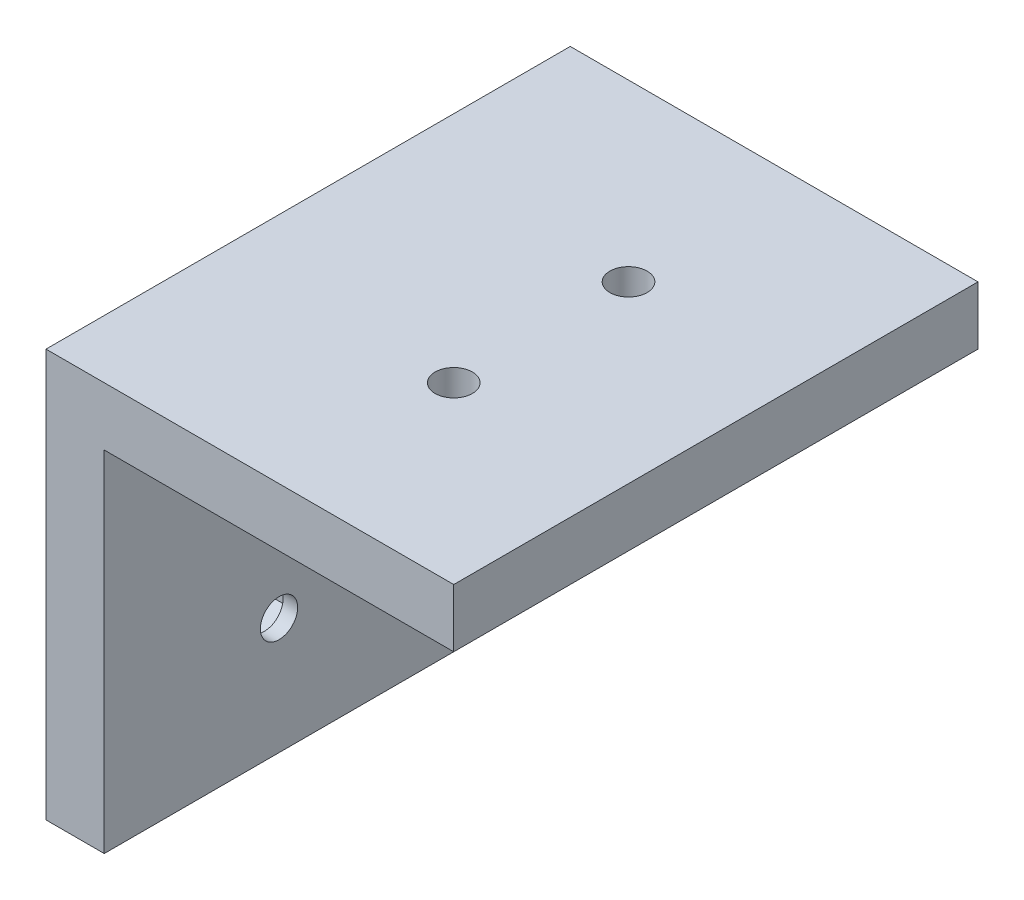
ISO-10303-21;
HEADER;
FILE_DESCRIPTION(('STEP AP214'),'2;1');
FILE_NAME('part.step','',(''),(''),'','','');
FILE_SCHEMA(('AUTOMOTIVE_DESIGN { 1 0 10303 214 1 1 1 1 }'));
ENDSEC;
DATA;
#1=APPLICATION_CONTEXT('core data for automotive mechanical design processes');
#2=APPLICATION_PROTOCOL_DEFINITION('international standard','automotive_design',2000,#1);
#3=PRODUCT_CONTEXT('',#1,'mechanical');
#4=PRODUCT('Part','Part','',(#3));
#5=PRODUCT_RELATED_PRODUCT_CATEGORY('part','',(#4));
#6=PRODUCT_DEFINITION_FORMATION('','',#4);
#7=PRODUCT_DEFINITION_CONTEXT('part definition',#1,'design');
#8=PRODUCT_DEFINITION('design','',#6,#7);
#9=PRODUCT_DEFINITION_SHAPE('','',#8);
#10=(LENGTH_UNIT() NAMED_UNIT(*) SI_UNIT(.MILLI.,.METRE.));
#11=(NAMED_UNIT(*) PLANE_ANGLE_UNIT() SI_UNIT($,.RADIAN.));
#12=(NAMED_UNIT(*) SI_UNIT($,.STERADIAN.) SOLID_ANGLE_UNIT());
#13=UNCERTAINTY_MEASURE_WITH_UNIT(LENGTH_MEASURE(1.E-05),#10,'distance_accuracy_value','');
#14=(GEOMETRIC_REPRESENTATION_CONTEXT(3) GLOBAL_UNCERTAINTY_ASSIGNED_CONTEXT((#13)) GLOBAL_UNIT_ASSIGNED_CONTEXT((#10,
#11,#12)) REPRESENTATION_CONTEXT('',''));
#15=CARTESIAN_POINT('',(0.,0.,0.));
#16=DIRECTION('',(0.,0.,1.));
#17=DIRECTION('',(1.,0.,0.));
#18=AXIS2_PLACEMENT_3D('',#15,#16,#17);
#19=CARTESIAN_POINT('',(-5.001,-20.,15.));
#20=DIRECTION('',(1.,0.,0.));
#21=DIRECTION('',(0.,1.,0.));
#22=AXIS2_PLACEMENT_3D('',#19,#20,#21);
#23=CYLINDRICAL_SURFACE('',#22,1.6);
#24=CARTESIAN_POINT('',(-5.,-20.,15.));
#25=DIRECTION('',(1.,0.,0.));
#26=DIRECTION('',(0.,0.,-1.));
#27=AXIS2_PLACEMENT_3D('',#24,#25,#26);
#28=CIRCLE('',#27,1.6);
#29=CARTESIAN_POINT('',(-5.,-20.,13.4));
#30=VERTEX_POINT('',#29);
#31=EDGE_CURVE('E170',#30,#30,#28,.F.);
#32=ORIENTED_EDGE('',*,*,#31,.T.);
#33=EDGE_LOOP('',(#32));
#34=FACE_BOUND('',#33,.T.);
#35=CARTESIAN_POINT('',(-3.75,-20.,15.));
#36=DIRECTION('',(1.,0.,0.));
#37=DIRECTION('',(0.,1.,0.));
#38=AXIS2_PLACEMENT_3D('',#35,#36,#37);
#39=CIRCLE('',#38,1.6);
#40=CARTESIAN_POINT('',(-3.75,-18.4,15.));
#41=VERTEX_POINT('',#40);
#42=EDGE_CURVE('E37',#41,#41,#39,.F.);
#43=ORIENTED_EDGE('',*,*,#42,.F.);
#44=EDGE_LOOP('',(#43));
#45=FACE_BOUND('',#44,.T.);
#46=ADVANCED_FACE('F33',(#34,#45),#23,.F.);
#47=CARTESIAN_POINT('',(-5.001,-20.,30.));
#48=DIRECTION('',(1.,0.,0.));
#49=DIRECTION('',(0.,1.,0.));
#50=AXIS2_PLACEMENT_3D('',#47,#48,#49);
#51=CYLINDRICAL_SURFACE('',#50,1.6);
#52=CARTESIAN_POINT('',(-5.,-20.,30.));
#53=DIRECTION('',(1.,0.,0.));
#54=DIRECTION('',(0.,0.,-1.));
#55=AXIS2_PLACEMENT_3D('',#52,#53,#54);
#56=CIRCLE('',#55,1.6);
#57=CARTESIAN_POINT('',(-5.,-20.,28.4));
#58=VERTEX_POINT('',#57);
#59=EDGE_CURVE('E128',#58,#58,#56,.F.);
#60=ORIENTED_EDGE('',*,*,#59,.T.);
#61=EDGE_LOOP('',(#60));
#62=FACE_BOUND('',#61,.T.);
#63=CARTESIAN_POINT('',(-3.75,-20.,30.));
#64=DIRECTION('',(1.,0.,0.));
#65=DIRECTION('',(0.,1.,0.));
#66=AXIS2_PLACEMENT_3D('',#63,#64,#65);
#67=CIRCLE('',#66,1.6);
#68=CARTESIAN_POINT('',(-3.75,-18.4,30.));
#69=VERTEX_POINT('',#68);
#70=EDGE_CURVE('E144',#69,#69,#67,.F.);
#71=ORIENTED_EDGE('',*,*,#70,.F.);
#72=EDGE_LOOP('',(#71));
#73=FACE_BOUND('',#72,.T.);
#74=ADVANCED_FACE('F205',(#62,#73),#51,.F.);
#75=CARTESIAN_POINT('',(0.,0.,45.));
#76=DIRECTION('',(0.,1.,0.));
#77=DIRECTION('',(0.,0.,1.));
#78=AXIS2_PLACEMENT_3D('',#75,#76,#77);
#79=PLANE('',#78);
#80=CARTESIAN_POINT('',(15.,0.,30.));
#81=DIRECTION('',(0.,-1.,0.));
#82=DIRECTION('',(0.,0.,-1.));
#83=AXIS2_PLACEMENT_3D('',#80,#81,#82);
#84=CIRCLE('',#83,1.6);
#85=CARTESIAN_POINT('',(15.,0.,28.4));
#86=VERTEX_POINT('',#85);
#87=EDGE_CURVE('E161',#86,#86,#84,.T.);
#88=ORIENTED_EDGE('',*,*,#87,.F.);
#89=EDGE_LOOP('',(#88));
#90=FACE_BOUND('',#89,.T.);
#91=CARTESIAN_POINT('',(15.,0.,15.));
#92=DIRECTION('',(0.,-1.,0.));
#93=DIRECTION('',(0.,0.,-1.));
#94=AXIS2_PLACEMENT_3D('',#91,#92,#93);
#95=CIRCLE('',#94,1.6);
#96=CARTESIAN_POINT('',(15.,0.,13.4));
#97=VERTEX_POINT('',#96);
#98=EDGE_CURVE('E152',#97,#97,#95,.T.);
#99=ORIENTED_EDGE('',*,*,#98,.F.);
#100=EDGE_LOOP('',(#99));
#101=FACE_BOUND('',#100,.T.);
#102=DIRECTION('',(1.,0.,0.));
#103=VECTOR('',#102,1.);
#104=CARTESIAN_POINT('',(0.,0.,0.));
#105=LINE('',#104,#103);
#106=CARTESIAN_POINT('',(0.,0.,0.));
#107=VERTEX_POINT('',#106);
#108=CARTESIAN_POINT('',(30.,0.,0.));
#109=VERTEX_POINT('',#108);
#110=EDGE_CURVE('E124',#107,#109,#105,.T.);
#111=ORIENTED_EDGE('',*,*,#110,.T.);
#112=DIRECTION('',(0.,0.,-1.));
#113=VECTOR('',#112,1.);
#114=CARTESIAN_POINT('',(30.,0.,45.));
#115=LINE('',#114,#113);
#116=CARTESIAN_POINT('',(30.,0.,45.));
#117=VERTEX_POINT('',#116);
#118=EDGE_CURVE('E11',#117,#109,#115,.T.);
#119=ORIENTED_EDGE('',*,*,#118,.F.);
#120=DIRECTION('',(1.,0.,0.));
#121=VECTOR('',#120,1.);
#122=CARTESIAN_POINT('',(0.,0.,45.));
#123=LINE('',#122,#121);
#124=CARTESIAN_POINT('',(0.,0.,45.));
#125=VERTEX_POINT('',#124);
#126=EDGE_CURVE('E135',#125,#117,#123,.T.);
#127=ORIENTED_EDGE('',*,*,#126,.F.);
#128=DIRECTION('',(0.,0.,-1.));
#129=VECTOR('',#128,1.);
#130=CARTESIAN_POINT('',(0.,0.,45.));
#131=LINE('',#130,#129);
#132=EDGE_CURVE('E120',#125,#107,#131,.T.);
#133=ORIENTED_EDGE('',*,*,#132,.T.);
#134=EDGE_LOOP('',(#111,#119,#127,#133));
#135=FACE_BOUND('',#134,.T.);
#136=ADVANCED_FACE('F35',(#90,#101,#135),#79,.F.);
#137=CARTESIAN_POINT('',(30.,0.,45.));
#138=DIRECTION('',(-1.,0.,0.));
#139=DIRECTION('',(0.,0.,1.));
#140=AXIS2_PLACEMENT_3D('',#137,#138,#139);
#141=PLANE('',#140);
#142=DIRECTION('',(0.,1.,0.));
#143=VECTOR('',#142,1.);
#144=CARTESIAN_POINT('',(30.,0.,0.));
#145=LINE('',#144,#143);
#146=CARTESIAN_POINT('',(30.,5.,0.));
#147=VERTEX_POINT('',#146);
#148=EDGE_CURVE('E127',#109,#147,#145,.T.);
#149=ORIENTED_EDGE('',*,*,#148,.T.);
#150=DIRECTION('',(0.,0.,-1.));
#151=VECTOR('',#150,1.);
#152=CARTESIAN_POINT('',(30.,5.,45.));
#153=LINE('',#152,#151);
#154=CARTESIAN_POINT('',(30.,5.,45.));
#155=VERTEX_POINT('',#154);
#156=EDGE_CURVE('E43',#155,#147,#153,.T.);
#157=ORIENTED_EDGE('',*,*,#156,.F.);
#158=DIRECTION('',(0.,1.,0.));
#159=VECTOR('',#158,1.);
#160=CARTESIAN_POINT('',(30.,0.,45.));
#161=LINE('',#160,#159);
#162=EDGE_CURVE('E90',#117,#155,#161,.T.);
#163=ORIENTED_EDGE('',*,*,#162,.F.);
#164=ORIENTED_EDGE('',*,*,#118,.T.);
#165=EDGE_LOOP('',(#149,#157,#163,#164));
#166=FACE_BOUND('',#165,.T.);
#167=ADVANCED_FACE('F181',(#166),#141,.F.);
#168=CARTESIAN_POINT('',(-5.,5.,45.));
#169=DIRECTION('',(0.,-1.,0.));
#170=DIRECTION('',(0.,0.,-1.));
#171=AXIS2_PLACEMENT_3D('',#168,#169,#170);
#172=PLANE('',#171);
#173=CARTESIAN_POINT('',(15.,5.,30.));
#174=DIRECTION('',(0.,-1.,0.));
#175=DIRECTION('',(0.,0.,-1.));
#176=AXIS2_PLACEMENT_3D('',#173,#174,#175);
#177=CIRCLE('',#176,1.6);
#178=CARTESIAN_POINT('',(15.,5.,28.4));
#179=VERTEX_POINT('',#178);
#180=EDGE_CURVE('E164',#179,#179,#177,.F.);
#181=ORIENTED_EDGE('',*,*,#180,.F.);
#182=EDGE_LOOP('',(#181));
#183=FACE_BOUND('',#182,.T.);
#184=CARTESIAN_POINT('',(15.,5.,15.));
#185=DIRECTION('',(0.,-1.,0.));
#186=DIRECTION('',(0.,0.,-1.));
#187=AXIS2_PLACEMENT_3D('',#184,#185,#186);
#188=CIRCLE('',#187,1.6);
#189=CARTESIAN_POINT('',(15.,5.,13.4));
#190=VERTEX_POINT('',#189);
#191=EDGE_CURVE('E156',#190,#190,#188,.F.);
#192=ORIENTED_EDGE('',*,*,#191,.F.);
#193=EDGE_LOOP('',(#192));
#194=FACE_BOUND('',#193,.T.);
#195=DIRECTION('',(-1.,0.,0.));
#196=VECTOR('',#195,1.);
#197=CARTESIAN_POINT('',(-5.,5.,0.));
#198=LINE('',#197,#196);
#199=CARTESIAN_POINT('',(-5.,5.,0.));
#200=VERTEX_POINT('',#199);
#201=EDGE_CURVE('E130',#147,#200,#198,.T.);
#202=ORIENTED_EDGE('',*,*,#201,.T.);
#203=DIRECTION('',(0.,0.,-1.));
#204=VECTOR('',#203,1.);
#205=CARTESIAN_POINT('',(-5.,5.,45.));
#206=LINE('',#205,#204);
#207=CARTESIAN_POINT('',(-5.,5.,45.));
#208=VERTEX_POINT('',#207);
#209=EDGE_CURVE('E115',#208,#200,#206,.T.);
#210=ORIENTED_EDGE('',*,*,#209,.F.);
#211=DIRECTION('',(-1.,0.,0.));
#212=VECTOR('',#211,1.);
#213=CARTESIAN_POINT('',(-5.,5.,45.));
#214=LINE('',#213,#212);
#215=EDGE_CURVE('E106',#155,#208,#214,.T.);
#216=ORIENTED_EDGE('',*,*,#215,.F.);
#217=ORIENTED_EDGE('',*,*,#156,.T.);
#218=EDGE_LOOP('',(#202,#210,#216,#217));
#219=FACE_BOUND('',#218,.T.);
#220=ADVANCED_FACE('F184',(#183,#194,#219),#172,.F.);
#221=CARTESIAN_POINT('',(-5.,-30.,45.));
#222=DIRECTION('',(1.,0.,0.));
#223=DIRECTION('',(0.,0.,-1.));
#224=AXIS2_PLACEMENT_3D('',#221,#222,#223);
#225=PLANE('',#224);
#226=ORIENTED_EDGE('',*,*,#59,.F.);
#227=EDGE_LOOP('',(#226));
#228=FACE_BOUND('',#227,.T.);
#229=ORIENTED_EDGE('',*,*,#31,.F.);
#230=EDGE_LOOP('',(#229));
#231=FACE_BOUND('',#230,.T.);
#232=DIRECTION('',(0.,-1.,0.));
#233=VECTOR('',#232,1.);
#234=CARTESIAN_POINT('',(-5.,-30.,0.));
#235=LINE('',#234,#233);
#236=CARTESIAN_POINT('',(-5.,-30.,0.));
#237=VERTEX_POINT('',#236);
#238=EDGE_CURVE('E114',#200,#237,#235,.T.);
#239=ORIENTED_EDGE('',*,*,#238,.T.);
#240=DIRECTION('',(0.,0.,-1.));
#241=VECTOR('',#240,1.);
#242=CARTESIAN_POINT('',(-5.,-30.,45.));
#243=LINE('',#242,#241);
#244=CARTESIAN_POINT('',(-5.,-30.,45.));
#245=VERTEX_POINT('',#244);
#246=EDGE_CURVE('E111',#245,#237,#243,.T.);
#247=ORIENTED_EDGE('',*,*,#246,.F.);
#248=DIRECTION('',(0.,-1.,0.));
#249=VECTOR('',#248,1.);
#250=CARTESIAN_POINT('',(-5.,-30.,45.));
#251=LINE('',#250,#249);
#252=EDGE_CURVE('E100',#208,#245,#251,.T.);
#253=ORIENTED_EDGE('',*,*,#252,.F.);
#254=ORIENTED_EDGE('',*,*,#209,.T.);
#255=EDGE_LOOP('',(#239,#247,#253,#254));
#256=FACE_BOUND('',#255,.T.);
#257=ADVANCED_FACE('F112',(#228,#231,#256),#225,.F.);
#258=CARTESIAN_POINT('',(0.,-30.,45.));
#259=DIRECTION('',(0.,1.,0.));
#260=DIRECTION('',(0.,0.,1.));
#261=AXIS2_PLACEMENT_3D('',#258,#259,#260);
#262=PLANE('',#261);
#263=DIRECTION('',(1.,0.,0.));
#264=VECTOR('',#263,1.);
#265=CARTESIAN_POINT('',(0.,-30.,0.));
#266=LINE('',#265,#264);
#267=CARTESIAN_POINT('',(0.,-30.,0.));
#268=VERTEX_POINT('',#267);
#269=EDGE_CURVE('E76',#237,#268,#266,.T.);
#270=ORIENTED_EDGE('',*,*,#269,.T.);
#271=DIRECTION('',(0.,0.,-1.));
#272=VECTOR('',#271,1.);
#273=CARTESIAN_POINT('',(0.,-30.,45.));
#274=LINE('',#273,#272);
#275=CARTESIAN_POINT('',(0.,-30.,45.));
#276=VERTEX_POINT('',#275);
#277=EDGE_CURVE('E116',#276,#268,#274,.T.);
#278=ORIENTED_EDGE('',*,*,#277,.F.);
#279=DIRECTION('',(1.,0.,0.));
#280=VECTOR('',#279,1.);
#281=CARTESIAN_POINT('',(0.,-30.,45.));
#282=LINE('',#281,#280);
#283=EDGE_CURVE('E104',#245,#276,#282,.T.);
#284=ORIENTED_EDGE('',*,*,#283,.F.);
#285=ORIENTED_EDGE('',*,*,#246,.T.);
#286=EDGE_LOOP('',(#270,#278,#284,#285));
#287=FACE_BOUND('',#286,.T.);
#288=ADVANCED_FACE('F118',(#287),#262,.F.);
#289=CARTESIAN_POINT('',(0.,0.,45.));
#290=DIRECTION('',(-1.,0.,0.));
#291=DIRECTION('',(0.,-1.,0.));
#292=AXIS2_PLACEMENT_3D('',#289,#290,#291);
#293=PLANE('',#292);
#294=CARTESIAN_POINT('',(0.,-20.,30.));
#295=DIRECTION('',(1.,0.,0.));
#296=DIRECTION('',(0.,1.,0.));
#297=AXIS2_PLACEMENT_3D('',#294,#295,#296);
#298=CIRCLE('',#297,1.6);
#299=CARTESIAN_POINT('',(0.,-18.4,30.));
#300=VERTEX_POINT('',#299);
#301=EDGE_CURVE('E167',#300,#300,#298,.T.);
#302=ORIENTED_EDGE('',*,*,#301,.F.);
#303=EDGE_LOOP('',(#302));
#304=FACE_BOUND('',#303,.T.);
#305=CARTESIAN_POINT('',(0.,-20.,15.));
#306=DIRECTION('',(1.,0.,0.));
#307=DIRECTION('',(0.,1.,0.));
#308=AXIS2_PLACEMENT_3D('',#305,#306,#307);
#309=CIRCLE('',#308,1.6);
#310=CARTESIAN_POINT('',(0.,-18.4,15.));
#311=VERTEX_POINT('',#310);
#312=EDGE_CURVE('E173',#311,#311,#309,.T.);
#313=ORIENTED_EDGE('',*,*,#312,.F.);
#314=EDGE_LOOP('',(#313));
#315=FACE_BOUND('',#314,.T.);
#316=DIRECTION('',(0.,1.,0.));
#317=VECTOR('',#316,1.);
#318=CARTESIAN_POINT('',(0.,0.,0.));
#319=LINE('',#318,#317);
#320=EDGE_CURVE('E82',#268,#107,#319,.T.);
#321=ORIENTED_EDGE('',*,*,#320,.T.);
#322=ORIENTED_EDGE('',*,*,#132,.F.);
#323=DIRECTION('',(0.,1.,0.));
#324=VECTOR('',#323,1.);
#325=CARTESIAN_POINT('',(0.,0.,45.));
#326=LINE('',#325,#324);
#327=EDGE_CURVE('E52',#276,#125,#326,.T.);
#328=ORIENTED_EDGE('',*,*,#327,.F.);
#329=ORIENTED_EDGE('',*,*,#277,.T.);
#330=EDGE_LOOP('',(#321,#322,#328,#329));
#331=FACE_BOUND('',#330,.T.);
#332=ADVANCED_FACE('F189',(#304,#315,#331),#293,.F.);
#333=CARTESIAN_POINT('',(0.,0.,45.));
#334=DIRECTION('',(0.,0.,1.));
#335=DIRECTION('',(1.,0.,0.));
#336=AXIS2_PLACEMENT_3D('',#333,#334,#335);
#337=PLANE('',#336);
#338=ORIENTED_EDGE('',*,*,#126,.T.);
#339=ORIENTED_EDGE('',*,*,#162,.T.);
#340=ORIENTED_EDGE('',*,*,#215,.T.);
#341=ORIENTED_EDGE('',*,*,#252,.T.);
#342=ORIENTED_EDGE('',*,*,#283,.T.);
#343=ORIENTED_EDGE('',*,*,#327,.T.);
#344=EDGE_LOOP('',(#338,#339,#340,#341,#342,#343));
#345=FACE_BOUND('',#344,.T.);
#346=ADVANCED_FACE('F102',(#345),#337,.T.);
#347=CARTESIAN_POINT('',(0.,0.,0.));
#348=DIRECTION('',(0.,0.,1.));
#349=DIRECTION('',(1.,0.,0.));
#350=AXIS2_PLACEMENT_3D('',#347,#348,#349);
#351=PLANE('',#350);
#352=ORIENTED_EDGE('',*,*,#110,.F.);
#353=ORIENTED_EDGE('',*,*,#320,.F.);
#354=ORIENTED_EDGE('',*,*,#269,.F.);
#355=ORIENTED_EDGE('',*,*,#238,.F.);
#356=ORIENTED_EDGE('',*,*,#201,.F.);
#357=ORIENTED_EDGE('',*,*,#148,.F.);
#358=EDGE_LOOP('',(#352,#353,#354,#355,#356,#357));
#359=FACE_BOUND('',#358,.T.);
#360=ADVANCED_FACE('F187',(#359),#351,.F.);
#361=CARTESIAN_POINT('',(-1.25,-20.,15.));
#362=DIRECTION('',(1.,0.,0.));
#363=DIRECTION('',(0.,1.,0.));
#364=AXIS2_PLACEMENT_3D('',#361,#362,#363);
#365=CIRCLE('',#364,1.6);
#366=CARTESIAN_POINT('',(-1.25,-18.4,15.));
#367=VERTEX_POINT('',#366);
#368=EDGE_CURVE('E147',#367,#367,#365,.F.);
#369=ORIENTED_EDGE('',*,*,#368,.T.);
#370=EDGE_LOOP('',(#369));
#371=FACE_BOUND('',#370,.T.);
#372=ORIENTED_EDGE('',*,*,#312,.T.);
#373=EDGE_LOOP('',(#372));
#374=FACE_BOUND('',#373,.T.);
#375=ADVANCED_FACE('F208',(#371,#374),#23,.F.);
#376=CARTESIAN_POINT('',(-1.25,-20.,30.));
#377=DIRECTION('',(1.,0.,0.));
#378=DIRECTION('',(0.,1.,0.));
#379=AXIS2_PLACEMENT_3D('',#376,#377,#378);
#380=CIRCLE('',#379,1.6);
#381=CARTESIAN_POINT('',(-1.25,-18.4,30.));
#382=VERTEX_POINT('',#381);
#383=EDGE_CURVE('E141',#382,#382,#380,.F.);
#384=ORIENTED_EDGE('',*,*,#383,.T.);
#385=EDGE_LOOP('',(#384));
#386=FACE_BOUND('',#385,.T.);
#387=ORIENTED_EDGE('',*,*,#301,.T.);
#388=EDGE_LOOP('',(#387));
#389=FACE_BOUND('',#388,.T.);
#390=ADVANCED_FACE('F215',(#386,#389),#51,.F.);
#391=CARTESIAN_POINT('',(15.,5.001,15.));
#392=DIRECTION('',(0.,-1.,0.));
#393=DIRECTION('',(0.,0.,-1.));
#394=AXIS2_PLACEMENT_3D('',#391,#392,#393);
#395=CYLINDRICAL_SURFACE('',#394,1.6);
#396=ORIENTED_EDGE('',*,*,#98,.T.);
#397=EDGE_LOOP('',(#396));
#398=FACE_BOUND('',#397,.T.);
#399=ORIENTED_EDGE('',*,*,#191,.T.);
#400=EDGE_LOOP('',(#399));
#401=FACE_BOUND('',#400,.T.);
#402=ADVANCED_FACE('F221',(#398,#401),#395,.F.);
#403=CARTESIAN_POINT('',(15.,5.001,30.));
#404=DIRECTION('',(0.,-1.,0.));
#405=DIRECTION('',(0.,0.,-1.));
#406=AXIS2_PLACEMENT_3D('',#403,#404,#405);
#407=CYLINDRICAL_SURFACE('',#406,1.6);
#408=ORIENTED_EDGE('',*,*,#87,.T.);
#409=EDGE_LOOP('',(#408));
#410=FACE_BOUND('',#409,.T.);
#411=ORIENTED_EDGE('',*,*,#180,.T.);
#412=EDGE_LOOP('',(#411));
#413=FACE_BOUND('',#412,.T.);
#414=ADVANCED_FACE('F248',(#410,#413),#407,.F.);
#415=CARTESIAN_POINT('',(-3.75,0.,0.));
#416=DIRECTION('',(1.,0.,0.));
#417=DIRECTION('',(0.,1.,0.));
#418=AXIS2_PLACEMENT_3D('',#415,#416,#417);
#419=PLANE('',#418);
#420=DIRECTION('',(0.,-0.5,-0.866025403784439));
#421=VECTOR('',#420,1.);
#422=CARTESIAN_POINT('',(-3.75,-21.7176170508391,32.975));
#423=LINE('',#422,#421);
#424=CARTESIAN_POINT('',(-3.75,-21.7176170508391,32.975));
#425=VERTEX_POINT('',#424);
#426=CARTESIAN_POINT('',(-3.75,-23.4352341016783,30.));
#427=VERTEX_POINT('',#426);
#428=EDGE_CURVE('E578',#425,#427,#423,.T.);
#429=ORIENTED_EDGE('',*,*,#428,.T.);
#430=DIRECTION('',(0.,0.5,-0.866025403784439));
#431=VECTOR('',#430,1.);
#432=CARTESIAN_POINT('',(-3.75,-23.4352341016783,30.));
#433=LINE('',#432,#431);
#434=CARTESIAN_POINT('',(-3.75,-21.7176170508391,27.025));
#435=VERTEX_POINT('',#434);
#436=EDGE_CURVE('E604',#427,#435,#433,.T.);
#437=ORIENTED_EDGE('',*,*,#436,.T.);
#438=DIRECTION('',(0.,1.,0.));
#439=VECTOR('',#438,1.);
#440=CARTESIAN_POINT('',(-3.75,-21.7176170508391,27.025));
#441=LINE('',#440,#439);
#442=CARTESIAN_POINT('',(-3.75,-18.2823829491609,27.025));
#443=VERTEX_POINT('',#442);
#444=EDGE_CURVE('E601',#435,#443,#441,.T.);
#445=ORIENTED_EDGE('',*,*,#444,.T.);
#446=DIRECTION('',(0.,0.499999999999999,0.866025403784439));
#447=VECTOR('',#446,1.);
#448=CARTESIAN_POINT('',(-3.75,-18.2823829491609,27.025));
#449=LINE('',#448,#447);
#450=CARTESIAN_POINT('',(-3.75,-16.5647658983217,30.));
#451=VERTEX_POINT('',#450);
#452=EDGE_CURVE('E598',#443,#451,#449,.T.);
#453=ORIENTED_EDGE('',*,*,#452,.T.);
#454=DIRECTION('',(0.,-0.5,0.866025403784439));
#455=VECTOR('',#454,1.);
#456=CARTESIAN_POINT('',(-3.75,-16.5647658983217,30.));
#457=LINE('',#456,#455);
#458=CARTESIAN_POINT('',(-3.75,-18.2823829491609,32.975));
#459=VERTEX_POINT('',#458);
#460=EDGE_CURVE('E595',#451,#459,#457,.T.);
#461=ORIENTED_EDGE('',*,*,#460,.T.);
#462=DIRECTION('',(0.,-1.,0.));
#463=VECTOR('',#462,1.);
#464=CARTESIAN_POINT('',(-3.75,-18.2823829491609,32.975));
#465=LINE('',#464,#463);
#466=EDGE_CURVE('E561',#459,#425,#465,.T.);
#467=ORIENTED_EDGE('',*,*,#466,.T.);
#468=EDGE_LOOP('',(#429,#437,#445,#453,#461,#467));
#469=FACE_BOUND('',#468,.T.);
#470=ORIENTED_EDGE('',*,*,#70,.T.);
#471=EDGE_LOOP('',(#470));
#472=FACE_BOUND('',#471,.T.);
#473=ADVANCED_FACE('F254',(#469,#472),#419,.T.);
#474=CARTESIAN_POINT('',(-1.25,0.,0.));
#475=DIRECTION('',(1.,0.,0.));
#476=DIRECTION('',(0.,1.,0.));
#477=AXIS2_PLACEMENT_3D('',#474,#475,#476);
#478=PLANE('',#477);
#479=DIRECTION('',(0.,-0.5,-0.866025403784439));
#480=VECTOR('',#479,1.);
#481=CARTESIAN_POINT('',(-1.25,-21.7176170508391,32.975));
#482=LINE('',#481,#480);
#483=CARTESIAN_POINT('',(-1.25,-21.7176170508391,32.975));
#484=VERTEX_POINT('',#483);
#485=CARTESIAN_POINT('',(-1.25,-23.4352341016783,30.));
#486=VERTEX_POINT('',#485);
#487=EDGE_CURVE('E466',#484,#486,#482,.T.);
#488=ORIENTED_EDGE('',*,*,#487,.F.);
#489=DIRECTION('',(0.,-1.,0.));
#490=VECTOR('',#489,1.);
#491=CARTESIAN_POINT('',(-1.25,-18.2823829491609,32.975));
#492=LINE('',#491,#490);
#493=CARTESIAN_POINT('',(-1.25,-18.2823829491609,32.975));
#494=VERTEX_POINT('',#493);
#495=EDGE_CURVE('E575',#494,#484,#492,.T.);
#496=ORIENTED_EDGE('',*,*,#495,.F.);
#497=DIRECTION('',(0.,-0.5,0.866025403784439));
#498=VECTOR('',#497,1.);
#499=CARTESIAN_POINT('',(-1.25,-16.5647658983217,30.));
#500=LINE('',#499,#498);
#501=CARTESIAN_POINT('',(-1.25,-16.5647658983217,30.));
#502=VERTEX_POINT('',#501);
#503=EDGE_CURVE('E579',#502,#494,#500,.T.);
#504=ORIENTED_EDGE('',*,*,#503,.F.);
#505=DIRECTION('',(0.,0.499999999999999,0.866025403784439));
#506=VECTOR('',#505,1.);
#507=CARTESIAN_POINT('',(-1.25,-18.2823829491609,27.025));
#508=LINE('',#507,#506);
#509=CARTESIAN_POINT('',(-1.25,-18.2823829491609,27.025));
#510=VERTEX_POINT('',#509);
#511=EDGE_CURVE('E582',#510,#502,#508,.T.);
#512=ORIENTED_EDGE('',*,*,#511,.F.);
#513=DIRECTION('',(0.,1.,0.));
#514=VECTOR('',#513,1.);
#515=CARTESIAN_POINT('',(-1.25,-21.7176170508391,27.025));
#516=LINE('',#515,#514);
#517=CARTESIAN_POINT('',(-1.25,-21.7176170508391,27.025));
#518=VERTEX_POINT('',#517);
#519=EDGE_CURVE('E585',#518,#510,#516,.T.);
#520=ORIENTED_EDGE('',*,*,#519,.F.);
#521=DIRECTION('',(0.,0.5,-0.866025403784439));
#522=VECTOR('',#521,1.);
#523=CARTESIAN_POINT('',(-1.25,-23.4352341016783,30.));
#524=LINE('',#523,#522);
#525=EDGE_CURVE('E588',#486,#518,#524,.T.);
#526=ORIENTED_EDGE('',*,*,#525,.F.);
#527=EDGE_LOOP('',(#488,#496,#504,#512,#520,#526));
#528=FACE_BOUND('',#527,.T.);
#529=ORIENTED_EDGE('',*,*,#383,.F.);
#530=EDGE_LOOP('',(#529));
#531=FACE_BOUND('',#530,.T.);
#532=ADVANCED_FACE('F272',(#528,#531),#478,.F.);
#533=CARTESIAN_POINT('',(-3.75,-21.7176170508391,32.975));
#534=DIRECTION('',(0.,-0.866025403784439,0.5));
#535=DIRECTION('',(0.,-0.5,-0.866025403784439));
#536=AXIS2_PLACEMENT_3D('',#533,#534,#535);
#537=PLANE('',#536);
#538=ORIENTED_EDGE('',*,*,#487,.T.);
#539=DIRECTION('',(1.,0.,0.));
#540=VECTOR('',#539,1.);
#541=CARTESIAN_POINT('',(-3.75,-23.4352341016783,30.));
#542=LINE('',#541,#540);
#543=EDGE_CURVE('E557',#427,#486,#542,.T.);
#544=ORIENTED_EDGE('',*,*,#543,.F.);
#545=ORIENTED_EDGE('',*,*,#428,.F.);
#546=DIRECTION('',(1.,0.,0.));
#547=VECTOR('',#546,1.);
#548=CARTESIAN_POINT('',(-3.75,-21.7176170508391,32.975));
#549=LINE('',#548,#547);
#550=EDGE_CURVE('E145',#425,#484,#549,.T.);
#551=ORIENTED_EDGE('',*,*,#550,.T.);
#552=EDGE_LOOP('',(#538,#544,#545,#551));
#553=FACE_BOUND('',#552,.T.);
#554=ADVANCED_FACE('F279',(#553),#537,.F.);
#555=CARTESIAN_POINT('',(-3.75,-18.2823829491609,32.975));
#556=DIRECTION('',(0.,0.,1.));
#557=DIRECTION('',(1.,0.,0.));
#558=AXIS2_PLACEMENT_3D('',#555,#556,#557);
#559=PLANE('',#558);
#560=ORIENTED_EDGE('',*,*,#495,.T.);
#561=ORIENTED_EDGE('',*,*,#550,.F.);
#562=ORIENTED_EDGE('',*,*,#466,.F.);
#563=DIRECTION('',(1.,0.,0.));
#564=VECTOR('',#563,1.);
#565=CARTESIAN_POINT('',(-3.75,-18.2823829491609,32.975));
#566=LINE('',#565,#564);
#567=EDGE_CURVE('E570',#459,#494,#566,.T.);
#568=ORIENTED_EDGE('',*,*,#567,.T.);
#569=EDGE_LOOP('',(#560,#561,#562,#568));
#570=FACE_BOUND('',#569,.T.);
#571=ADVANCED_FACE('F287',(#570),#559,.F.);
#572=CARTESIAN_POINT('',(-3.75,-16.5647658983217,30.));
#573=DIRECTION('',(0.,0.866025403784439,0.5));
#574=DIRECTION('',(0.,-0.5,0.866025403784439));
#575=AXIS2_PLACEMENT_3D('',#572,#573,#574);
#576=PLANE('',#575);
#577=ORIENTED_EDGE('',*,*,#503,.T.);
#578=ORIENTED_EDGE('',*,*,#567,.F.);
#579=ORIENTED_EDGE('',*,*,#460,.F.);
#580=DIRECTION('',(1.,0.,0.));
#581=VECTOR('',#580,1.);
#582=CARTESIAN_POINT('',(-3.75,-16.5647658983217,30.));
#583=LINE('',#582,#581);
#584=EDGE_CURVE('E567',#451,#502,#583,.T.);
#585=ORIENTED_EDGE('',*,*,#584,.T.);
#586=EDGE_LOOP('',(#577,#578,#579,#585));
#587=FACE_BOUND('',#586,.T.);
#588=ADVANCED_FACE('F295',(#587),#576,.F.);
#589=CARTESIAN_POINT('',(-3.75,-18.2823829491609,27.025));
#590=DIRECTION('',(0.,0.866025403784439,-0.499999999999999));
#591=DIRECTION('',(0.,0.499999999999999,0.866025403784439));
#592=AXIS2_PLACEMENT_3D('',#589,#590,#591);
#593=PLANE('',#592);
#594=ORIENTED_EDGE('',*,*,#511,.T.);
#595=ORIENTED_EDGE('',*,*,#584,.F.);
#596=ORIENTED_EDGE('',*,*,#452,.F.);
#597=DIRECTION('',(1.,0.,0.));
#598=VECTOR('',#597,1.);
#599=CARTESIAN_POINT('',(-3.75,-18.2823829491609,27.025));
#600=LINE('',#599,#598);
#601=EDGE_CURVE('E564',#443,#510,#600,.T.);
#602=ORIENTED_EDGE('',*,*,#601,.T.);
#603=EDGE_LOOP('',(#594,#595,#596,#602));
#604=FACE_BOUND('',#603,.T.);
#605=ADVANCED_FACE('F303',(#604),#593,.F.);
#606=CARTESIAN_POINT('',(-3.75,-21.7176170508391,27.025));
#607=DIRECTION('',(0.,0.,-1.));
#608=DIRECTION('',(-1.,0.,0.));
#609=AXIS2_PLACEMENT_3D('',#606,#607,#608);
#610=PLANE('',#609);
#611=ORIENTED_EDGE('',*,*,#519,.T.);
#612=ORIENTED_EDGE('',*,*,#601,.F.);
#613=ORIENTED_EDGE('',*,*,#444,.F.);
#614=DIRECTION('',(1.,0.,0.));
#615=VECTOR('',#614,1.);
#616=CARTESIAN_POINT('',(-3.75,-21.7176170508391,27.025));
#617=LINE('',#616,#615);
#618=EDGE_CURVE('E560',#435,#518,#617,.T.);
#619=ORIENTED_EDGE('',*,*,#618,.T.);
#620=EDGE_LOOP('',(#611,#612,#613,#619));
#621=FACE_BOUND('',#620,.T.);
#622=ADVANCED_FACE('F311',(#621),#610,.F.);
#623=CARTESIAN_POINT('',(-3.75,-23.4352341016783,30.));
#624=DIRECTION('',(0.,-0.866025403784439,-0.5));
#625=DIRECTION('',(0.,0.5,-0.866025403784439));
#626=AXIS2_PLACEMENT_3D('',#623,#624,#625);
#627=PLANE('',#626);
#628=ORIENTED_EDGE('',*,*,#525,.T.);
#629=ORIENTED_EDGE('',*,*,#618,.F.);
#630=ORIENTED_EDGE('',*,*,#436,.F.);
#631=ORIENTED_EDGE('',*,*,#543,.T.);
#632=EDGE_LOOP('',(#628,#629,#630,#631));
#633=FACE_BOUND('',#632,.T.);
#634=ADVANCED_FACE('F319',(#633),#627,.F.);
#635=CARTESIAN_POINT('',(-3.75,0.,0.));
#636=DIRECTION('',(1.,0.,0.));
#637=DIRECTION('',(0.,1.,0.));
#638=AXIS2_PLACEMENT_3D('',#635,#636,#637);
#639=PLANE('',#638);
#640=DIRECTION('',(0.,-0.5,-0.866025403784438));
#641=VECTOR('',#640,1.);
#642=CARTESIAN_POINT('',(-3.75,-21.7176170508391,17.975));
#643=LINE('',#642,#641);
#644=CARTESIAN_POINT('',(-3.75,-21.7176170508391,17.975));
#645=VERTEX_POINT('',#644);
#646=CARTESIAN_POINT('',(-3.75,-23.4352341016783,15.));
#647=VERTEX_POINT('',#646);
#648=EDGE_CURVE('E462',#645,#647,#643,.T.);
#649=ORIENTED_EDGE('',*,*,#648,.T.);
#650=DIRECTION('',(0.,0.500000000000001,-0.866025403784438));
#651=VECTOR('',#650,1.);
#652=CARTESIAN_POINT('',(-3.75,-23.4352341016783,15.));
#653=LINE('',#652,#651);
#654=CARTESIAN_POINT('',(-3.75,-21.7176170508391,12.025));
#655=VERTEX_POINT('',#654);
#656=EDGE_CURVE('E553',#647,#655,#653,.T.);
#657=ORIENTED_EDGE('',*,*,#656,.T.);
#658=DIRECTION('',(0.,1.,0.));
#659=VECTOR('',#658,1.);
#660=CARTESIAN_POINT('',(-3.75,-21.7176170508391,12.025));
#661=LINE('',#660,#659);
#662=CARTESIAN_POINT('',(-3.75,-18.2823829491609,12.025));
#663=VERTEX_POINT('',#662);
#664=EDGE_CURVE('E550',#655,#663,#661,.T.);
#665=ORIENTED_EDGE('',*,*,#664,.T.);
#666=DIRECTION('',(0.,0.5,0.866025403784438));
#667=VECTOR('',#666,1.);
#668=CARTESIAN_POINT('',(-3.75,-18.2823829491609,12.025));
#669=LINE('',#668,#667);
#670=CARTESIAN_POINT('',(-3.75,-16.5647658983217,15.));
#671=VERTEX_POINT('',#670);
#672=EDGE_CURVE('E545',#663,#671,#669,.T.);
#673=ORIENTED_EDGE('',*,*,#672,.T.);
#674=DIRECTION('',(0.,-0.5,0.866025403784439));
#675=VECTOR('',#674,1.);
#676=CARTESIAN_POINT('',(-3.75,-16.5647658983217,15.));
#677=LINE('',#676,#675);
#678=CARTESIAN_POINT('',(-3.75,-18.2823829491609,17.975));
#679=VERTEX_POINT('',#678);
#680=EDGE_CURVE('E540',#671,#679,#677,.T.);
#681=ORIENTED_EDGE('',*,*,#680,.T.);
#682=DIRECTION('',(0.,-1.,0.));
#683=VECTOR('',#682,1.);
#684=CARTESIAN_POINT('',(-3.75,-18.2823829491609,17.975));
#685=LINE('',#684,#683);
#686=EDGE_CURVE('E477',#679,#645,#685,.T.);
#687=ORIENTED_EDGE('',*,*,#686,.T.);
#688=EDGE_LOOP('',(#649,#657,#665,#673,#681,#687));
#689=FACE_BOUND('',#688,.T.);
#690=ORIENTED_EDGE('',*,*,#42,.T.);
#691=EDGE_LOOP('',(#690));
#692=FACE_BOUND('',#691,.T.);
#693=ADVANCED_FACE('F327',(#689,#692),#639,.T.);
#694=CARTESIAN_POINT('',(-1.25,0.,0.));
#695=DIRECTION('',(1.,0.,0.));
#696=DIRECTION('',(0.,1.,0.));
#697=AXIS2_PLACEMENT_3D('',#694,#695,#696);
#698=PLANE('',#697);
#699=DIRECTION('',(0.,-0.5,-0.866025403784438));
#700=VECTOR('',#699,1.);
#701=CARTESIAN_POINT('',(-1.25,-21.7176170508391,17.975));
#702=LINE('',#701,#700);
#703=CARTESIAN_POINT('',(-1.25,-21.7176170508391,17.975));
#704=VERTEX_POINT('',#703);
#705=CARTESIAN_POINT('',(-1.25,-23.4352341016783,15.));
#706=VERTEX_POINT('',#705);
#707=EDGE_CURVE('E446',#704,#706,#702,.T.);
#708=ORIENTED_EDGE('',*,*,#707,.F.);
#709=DIRECTION('',(0.,-1.,0.));
#710=VECTOR('',#709,1.);
#711=CARTESIAN_POINT('',(-1.25,-18.2823829491609,17.975));
#712=LINE('',#711,#710);
#713=CARTESIAN_POINT('',(-1.25,-18.2823829491609,17.975));
#714=VERTEX_POINT('',#713);
#715=EDGE_CURVE('E459',#714,#704,#712,.T.);
#716=ORIENTED_EDGE('',*,*,#715,.F.);
#717=DIRECTION('',(0.,-0.5,0.866025403784439));
#718=VECTOR('',#717,1.);
#719=CARTESIAN_POINT('',(-1.25,-16.5647658983217,15.));
#720=LINE('',#719,#718);
#721=CARTESIAN_POINT('',(-1.25,-16.5647658983217,15.));
#722=VERTEX_POINT('',#721);
#723=EDGE_CURVE('E456',#722,#714,#720,.T.);
#724=ORIENTED_EDGE('',*,*,#723,.F.);
#725=DIRECTION('',(0.,0.5,0.866025403784438));
#726=VECTOR('',#725,1.);
#727=CARTESIAN_POINT('',(-1.25,-18.2823829491609,12.025));
#728=LINE('',#727,#726);
#729=CARTESIAN_POINT('',(-1.25,-18.2823829491609,12.025));
#730=VERTEX_POINT('',#729);
#731=EDGE_CURVE('E449',#730,#722,#728,.T.);
#732=ORIENTED_EDGE('',*,*,#731,.F.);
#733=DIRECTION('',(0.,1.,0.));
#734=VECTOR('',#733,1.);
#735=CARTESIAN_POINT('',(-1.25,-21.7176170508391,12.025));
#736=LINE('',#735,#734);
#737=CARTESIAN_POINT('',(-1.25,-21.7176170508391,12.025));
#738=VERTEX_POINT('',#737);
#739=EDGE_CURVE('E445',#738,#730,#736,.T.);
#740=ORIENTED_EDGE('',*,*,#739,.F.);
#741=DIRECTION('',(0.,0.500000000000001,-0.866025403784438));
#742=VECTOR('',#741,1.);
#743=CARTESIAN_POINT('',(-1.25,-23.4352341016783,15.));
#744=LINE('',#743,#742);
#745=EDGE_CURVE('E431',#706,#738,#744,.T.);
#746=ORIENTED_EDGE('',*,*,#745,.F.);
#747=EDGE_LOOP('',(#708,#716,#724,#732,#740,#746));
#748=FACE_BOUND('',#747,.T.);
#749=ORIENTED_EDGE('',*,*,#368,.F.);
#750=EDGE_LOOP('',(#749));
#751=FACE_BOUND('',#750,.T.);
#752=ADVANCED_FACE('F335',(#748,#751),#698,.F.);
#753=CARTESIAN_POINT('',(-3.75,-21.7176170508391,17.975));
#754=DIRECTION('',(0.,-0.866025403784438,0.5));
#755=DIRECTION('',(0.,-0.5,-0.866025403784438));
#756=AXIS2_PLACEMENT_3D('',#753,#754,#755);
#757=PLANE('',#756);
#758=ORIENTED_EDGE('',*,*,#707,.T.);
#759=DIRECTION('',(1.,0.,0.));
#760=VECTOR('',#759,1.);
#761=CARTESIAN_POINT('',(-3.75,-23.4352341016783,15.));
#762=LINE('',#761,#760);
#763=EDGE_CURVE('E439',#647,#706,#762,.T.);
#764=ORIENTED_EDGE('',*,*,#763,.F.);
#765=ORIENTED_EDGE('',*,*,#648,.F.);
#766=DIRECTION('',(1.,0.,0.));
#767=VECTOR('',#766,1.);
#768=CARTESIAN_POINT('',(-3.75,-21.7176170508391,17.975));
#769=LINE('',#768,#767);
#770=EDGE_CURVE('E463',#645,#704,#769,.T.);
#771=ORIENTED_EDGE('',*,*,#770,.T.);
#772=EDGE_LOOP('',(#758,#764,#765,#771));
#773=FACE_BOUND('',#772,.T.);
#774=ADVANCED_FACE('F343',(#773),#757,.F.);
#775=CARTESIAN_POINT('',(-3.75,-18.2823829491609,17.975));
#776=DIRECTION('',(0.,0.,1.));
#777=DIRECTION('',(1.,0.,0.));
#778=AXIS2_PLACEMENT_3D('',#775,#776,#777);
#779=PLANE('',#778);
#780=ORIENTED_EDGE('',*,*,#715,.T.);
#781=ORIENTED_EDGE('',*,*,#770,.F.);
#782=ORIENTED_EDGE('',*,*,#686,.F.);
#783=DIRECTION('',(1.,0.,0.));
#784=VECTOR('',#783,1.);
#785=CARTESIAN_POINT('',(-3.75,-18.2823829491609,17.975));
#786=LINE('',#785,#784);
#787=EDGE_CURVE('E467',#679,#714,#786,.T.);
#788=ORIENTED_EDGE('',*,*,#787,.T.);
#789=EDGE_LOOP('',(#780,#781,#782,#788));
#790=FACE_BOUND('',#789,.T.);
#791=ADVANCED_FACE('F351',(#790),#779,.F.);
#792=CARTESIAN_POINT('',(-3.75,-16.5647658983217,15.));
#793=DIRECTION('',(0.,0.866025403784439,0.5));
#794=DIRECTION('',(0.,-0.5,0.866025403784439));
#795=AXIS2_PLACEMENT_3D('',#792,#793,#794);
#796=PLANE('',#795);
#797=ORIENTED_EDGE('',*,*,#723,.T.);
#798=ORIENTED_EDGE('',*,*,#787,.F.);
#799=ORIENTED_EDGE('',*,*,#680,.F.);
#800=DIRECTION('',(1.,0.,0.));
#801=VECTOR('',#800,1.);
#802=CARTESIAN_POINT('',(-3.75,-16.5647658983217,15.));
#803=LINE('',#802,#801);
#804=EDGE_CURVE('E470',#671,#722,#803,.T.);
#805=ORIENTED_EDGE('',*,*,#804,.T.);
#806=EDGE_LOOP('',(#797,#798,#799,#805));
#807=FACE_BOUND('',#806,.T.);
#808=ADVANCED_FACE('F359',(#807),#796,.F.);
#809=CARTESIAN_POINT('',(-3.75,-18.2823829491609,12.025));
#810=DIRECTION('',(0.,0.866025403784438,-0.5));
#811=DIRECTION('',(0.,0.5,0.866025403784438));
#812=AXIS2_PLACEMENT_3D('',#809,#810,#811);
#813=PLANE('',#812);
#814=ORIENTED_EDGE('',*,*,#731,.T.);
#815=ORIENTED_EDGE('',*,*,#804,.F.);
#816=ORIENTED_EDGE('',*,*,#672,.F.);
#817=DIRECTION('',(1.,0.,0.));
#818=VECTOR('',#817,1.);
#819=CARTESIAN_POINT('',(-3.75,-18.2823829491609,12.025));
#820=LINE('',#819,#818);
#821=EDGE_CURVE('E473',#663,#730,#820,.T.);
#822=ORIENTED_EDGE('',*,*,#821,.T.);
#823=EDGE_LOOP('',(#814,#815,#816,#822));
#824=FACE_BOUND('',#823,.T.);
#825=ADVANCED_FACE('F367',(#824),#813,.F.);
#826=CARTESIAN_POINT('',(-3.75,-21.7176170508391,12.025));
#827=DIRECTION('',(0.,0.,-1.));
#828=DIRECTION('',(0.,1.,0.));
#829=AXIS2_PLACEMENT_3D('',#826,#827,#828);
#830=PLANE('',#829);
#831=ORIENTED_EDGE('',*,*,#739,.T.);
#832=ORIENTED_EDGE('',*,*,#821,.F.);
#833=ORIENTED_EDGE('',*,*,#664,.F.);
#834=DIRECTION('',(1.,0.,0.));
#835=VECTOR('',#834,1.);
#836=CARTESIAN_POINT('',(-3.75,-21.7176170508391,12.025));
#837=LINE('',#836,#835);
#838=EDGE_CURVE('E435',#655,#738,#837,.T.);
#839=ORIENTED_EDGE('',*,*,#838,.T.);
#840=EDGE_LOOP('',(#831,#832,#833,#839));
#841=FACE_BOUND('',#840,.T.);
#842=ADVANCED_FACE('F375',(#841),#830,.F.);
#843=CARTESIAN_POINT('',(-3.75,-23.4352341016783,15.));
#844=DIRECTION('',(0.,-0.866025403784438,-0.500000000000001));
#845=DIRECTION('',(0.,0.500000000000001,-0.866025403784438));
#846=AXIS2_PLACEMENT_3D('',#843,#844,#845);
#847=PLANE('',#846);
#848=ORIENTED_EDGE('',*,*,#745,.T.);
#849=ORIENTED_EDGE('',*,*,#838,.F.);
#850=ORIENTED_EDGE('',*,*,#656,.F.);
#851=ORIENTED_EDGE('',*,*,#763,.T.);
#852=EDGE_LOOP('',(#848,#849,#850,#851));
#853=FACE_BOUND('',#852,.T.);
#854=ADVANCED_FACE('F383',(#853),#847,.F.);
#855=CLOSED_SHELL('',(#46,#74,#136,#167,#220,#257,#288,#332,#346,#360,#375,#390,#402,#414,#473,
#532,#554,#571,#588,#605,#622,#634,#693,#752,#774,#791,#808,#825,#842,#854));
#856=MANIFOLD_SOLID_BREP('B2',#855);
#857=ADVANCED_BREP_SHAPE_REPRESENTATION('',(#18,#856),#14);
#858=SHAPE_DEFINITION_REPRESENTATION(#9,#857);
ENDSEC;
END-ISO-10303-21;
